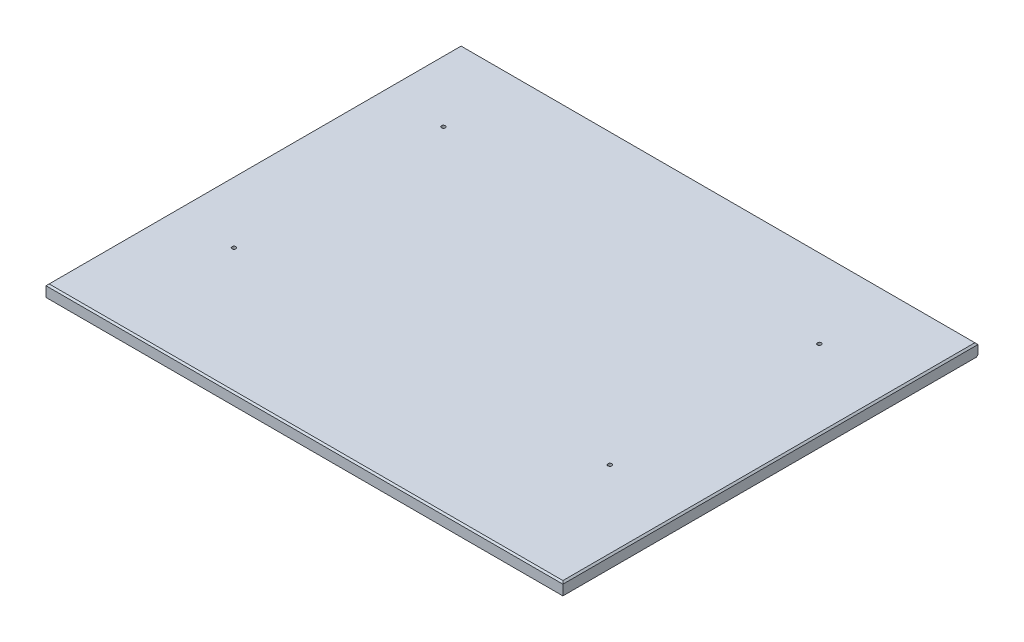
ISO-10303-21;
HEADER;
FILE_DESCRIPTION(('STEP AP214'),'2;1');
FILE_NAME('part.step','',(''),(''),'','','');
FILE_SCHEMA(('AUTOMOTIVE_DESIGN { 1 0 10303 214 1 1 1 1 }'));
ENDSEC;
DATA;
#1=APPLICATION_CONTEXT('core data for automotive mechanical design processes');
#2=APPLICATION_PROTOCOL_DEFINITION('international standard','automotive_design',2000,#1);
#3=PRODUCT_CONTEXT('',#1,'mechanical');
#4=PRODUCT('Part','Part','',(#3));
#5=PRODUCT_RELATED_PRODUCT_CATEGORY('part','',(#4));
#6=PRODUCT_DEFINITION_FORMATION('','',#4);
#7=PRODUCT_DEFINITION_CONTEXT('part definition',#1,'design');
#8=PRODUCT_DEFINITION('design','',#6,#7);
#9=PRODUCT_DEFINITION_SHAPE('','',#8);
#10=(LENGTH_UNIT() NAMED_UNIT(*) SI_UNIT(.MILLI.,.METRE.));
#11=(NAMED_UNIT(*) PLANE_ANGLE_UNIT() SI_UNIT($,.RADIAN.));
#12=(NAMED_UNIT(*) SI_UNIT($,.STERADIAN.) SOLID_ANGLE_UNIT());
#13=UNCERTAINTY_MEASURE_WITH_UNIT(LENGTH_MEASURE(1.E-05),#10,'distance_accuracy_value','');
#14=(GEOMETRIC_REPRESENTATION_CONTEXT(3) GLOBAL_UNCERTAINTY_ASSIGNED_CONTEXT((#13)) GLOBAL_UNIT_ASSIGNED_CONTEXT((#10,
#11,#12)) REPRESENTATION_CONTEXT('',''));
#15=CARTESIAN_POINT('',(0.,0.,0.));
#16=DIRECTION('',(0.,0.,1.));
#17=DIRECTION('',(1.,0.,0.));
#18=AXIS2_PLACEMENT_3D('',#15,#16,#17);
#19=CARTESIAN_POINT('',(0.,19.05,0.));
#20=DIRECTION('',(1.,0.,0.));
#21=DIRECTION('',(0.,0.,-1.));
#22=AXIS2_PLACEMENT_3D('',#19,#20,#21);
#23=PLANE('',#22);
#24=DIRECTION('',(0.,-1.,0.));
#25=VECTOR('',#24,1.);
#26=CARTESIAN_POINT('',(0.,19.05,-673.1));
#27=LINE('',#26,#25);
#28=CARTESIAN_POINT('',(0.,16.51,-673.1));
#29=VERTEX_POINT('',#28);
#30=CARTESIAN_POINT('',(0.,2.53999999999999,-673.1));
#31=VERTEX_POINT('',#30);
#32=EDGE_CURVE('E118',#29,#31,#27,.T.);
#33=ORIENTED_EDGE('',*,*,#32,.T.);
#34=DIRECTION('',(0.,-0.707106781186548,0.707106781186548));
#35=VECTOR('',#34,1.);
#36=CARTESIAN_POINT('',(0.,2.53999999999999,-673.1));
#37=LINE('',#36,#35);
#38=CARTESIAN_POINT('',(0.,0.,-670.56));
#39=VERTEX_POINT('',#38);
#40=EDGE_CURVE('E64',#31,#39,#37,.T.);
#41=ORIENTED_EDGE('',*,*,#40,.T.);
#42=DIRECTION('',(0.,0.,1.));
#43=VECTOR('',#42,1.);
#44=CARTESIAN_POINT('',(0.,0.,0.));
#45=LINE('',#44,#43);
#46=CARTESIAN_POINT('',(0.,0.,0.));
#47=VERTEX_POINT('',#46);
#48=EDGE_CURVE('E98',#39,#47,#45,.T.);
#49=ORIENTED_EDGE('',*,*,#48,.T.);
#50=DIRECTION('',(0.,-1.,0.));
#51=VECTOR('',#50,1.);
#52=CARTESIAN_POINT('',(0.,19.05,0.));
#53=LINE('',#52,#51);
#54=CARTESIAN_POINT('',(0.,16.51,0.));
#55=VERTEX_POINT('',#54);
#56=EDGE_CURVE('E100',#55,#47,#53,.T.);
#57=ORIENTED_EDGE('',*,*,#56,.F.);
#58=DIRECTION('',(0.,0.,-1.));
#59=VECTOR('',#58,1.);
#60=CARTESIAN_POINT('',(0.,16.51,0.));
#61=LINE('',#60,#59);
#62=EDGE_CURVE('E141',#55,#29,#61,.T.);
#63=ORIENTED_EDGE('',*,*,#62,.T.);
#64=EDGE_LOOP('',(#33,#41,#49,#57,#63));
#65=FACE_BOUND('',#64,.T.);
#66=ADVANCED_FACE('F41',(#65),#23,.F.);
#67=CARTESIAN_POINT('',(0.,19.05,0.));
#68=DIRECTION('',(0.,0.,-1.));
#69=DIRECTION('',(-1.,0.,0.));
#70=AXIS2_PLACEMENT_3D('',#67,#68,#69);
#71=PLANE('',#70);
#72=DIRECTION('',(0.,-1.,0.));
#73=VECTOR('',#72,1.);
#74=CARTESIAN_POINT('',(838.2,19.05,0.));
#75=LINE('',#74,#73);
#76=CARTESIAN_POINT('',(838.2,16.51,0.));
#77=VERTEX_POINT('',#76);
#78=CARTESIAN_POINT('',(838.2,0.,0.));
#79=VERTEX_POINT('',#78);
#80=EDGE_CURVE('E113',#77,#79,#75,.T.);
#81=ORIENTED_EDGE('',*,*,#80,.F.);
#82=DIRECTION('',(-1.,0.,0.));
#83=VECTOR('',#82,1.);
#84=CARTESIAN_POINT('',(0.,16.51,0.));
#85=LINE('',#84,#83);
#86=EDGE_CURVE('E111',#77,#55,#85,.T.);
#87=ORIENTED_EDGE('',*,*,#86,.T.);
#88=ORIENTED_EDGE('',*,*,#56,.T.);
#89=DIRECTION('',(1.,0.,0.));
#90=VECTOR('',#89,1.);
#91=CARTESIAN_POINT('',(0.,0.,0.));
#92=LINE('',#91,#90);
#93=EDGE_CURVE('E103',#47,#79,#92,.T.);
#94=ORIENTED_EDGE('',*,*,#93,.T.);
#95=EDGE_LOOP('',(#81,#87,#88,#94));
#96=FACE_BOUND('',#95,.T.);
#97=ADVANCED_FACE('F109',(#96),#71,.F.);
#98=CARTESIAN_POINT('',(838.2,19.05,0.));
#99=DIRECTION('',(-1.,0.,0.));
#100=DIRECTION('',(0.,0.,1.));
#101=AXIS2_PLACEMENT_3D('',#98,#99,#100);
#102=PLANE('',#101);
#103=DIRECTION('',(0.,0.,-1.));
#104=VECTOR('',#103,1.);
#105=CARTESIAN_POINT('',(838.2,0.,0.));
#106=LINE('',#105,#104);
#107=CARTESIAN_POINT('',(838.2,0.,-670.56));
#108=VERTEX_POINT('',#107);
#109=EDGE_CURVE('E116',#79,#108,#106,.T.);
#110=ORIENTED_EDGE('',*,*,#109,.T.);
#111=DIRECTION('',(0.,0.707106781186548,-0.707106781186548));
#112=VECTOR('',#111,1.);
#113=CARTESIAN_POINT('',(838.2,2.53999999999999,-673.1));
#114=LINE('',#113,#112);
#115=CARTESIAN_POINT('',(838.2,2.53999999999999,-673.1));
#116=VERTEX_POINT('',#115);
#117=EDGE_CURVE('E11',#108,#116,#114,.T.);
#118=ORIENTED_EDGE('',*,*,#117,.T.);
#119=DIRECTION('',(0.,-1.,0.));
#120=VECTOR('',#119,1.);
#121=CARTESIAN_POINT('',(838.2,19.05,-673.1));
#122=LINE('',#121,#120);
#123=CARTESIAN_POINT('',(838.2,16.51,-673.1));
#124=VERTEX_POINT('',#123);
#125=EDGE_CURVE('E123',#124,#116,#122,.T.);
#126=ORIENTED_EDGE('',*,*,#125,.F.);
#127=DIRECTION('',(0.,0.,1.));
#128=VECTOR('',#127,1.);
#129=CARTESIAN_POINT('',(838.2,16.51,0.));
#130=LINE('',#129,#128);
#131=EDGE_CURVE('E138',#124,#77,#130,.T.);
#132=ORIENTED_EDGE('',*,*,#131,.T.);
#133=ORIENTED_EDGE('',*,*,#80,.T.);
#134=EDGE_LOOP('',(#110,#118,#126,#132,#133));
#135=FACE_BOUND('',#134,.T.);
#136=ADVANCED_FACE('F175',(#135),#102,.F.);
#137=CARTESIAN_POINT('',(0.,19.05,-673.1));
#138=DIRECTION('',(0.,0.,1.));
#139=DIRECTION('',(1.,0.,0.));
#140=AXIS2_PLACEMENT_3D('',#137,#138,#139);
#141=PLANE('',#140);
#142=ORIENTED_EDGE('',*,*,#125,.T.);
#143=DIRECTION('',(-1.,0.,0.));
#144=VECTOR('',#143,1.);
#145=CARTESIAN_POINT('',(0.,2.53999999999999,-673.1));
#146=LINE('',#145,#144);
#147=EDGE_CURVE('E143',#116,#31,#146,.T.);
#148=ORIENTED_EDGE('',*,*,#147,.T.);
#149=ORIENTED_EDGE('',*,*,#32,.F.);
#150=DIRECTION('',(1.,0.,0.));
#151=VECTOR('',#150,1.);
#152=CARTESIAN_POINT('',(0.,16.51,-673.1));
#153=LINE('',#152,#151);
#154=EDGE_CURVE('E135',#29,#124,#153,.T.);
#155=ORIENTED_EDGE('',*,*,#154,.T.);
#156=EDGE_LOOP('',(#142,#148,#149,#155));
#157=FACE_BOUND('',#156,.T.);
#158=ADVANCED_FACE('F159',(#157),#141,.F.);
#159=CARTESIAN_POINT('',(0.,19.05,0.));
#160=DIRECTION('',(0.,-1.,0.));
#161=DIRECTION('',(0.,0.,-1.));
#162=AXIS2_PLACEMENT_3D('',#159,#160,#161);
#163=PLANE('',#162);
#164=CARTESIAN_POINT('',(101.6,19.05,-203.2));
#165=DIRECTION('',(0.,1.,0.));
#166=DIRECTION('',(0.,0.,1.));
#167=AXIS2_PLACEMENT_3D('',#164,#165,#166);
#168=CIRCLE('',#167,3.175);
#169=CARTESIAN_POINT('',(101.6,19.05,-200.025));
#170=VERTEX_POINT('',#169);
#171=EDGE_CURVE('E322',#170,#170,#168,.T.);
#172=ORIENTED_EDGE('',*,*,#171,.F.);
#173=EDGE_LOOP('',(#172));
#174=FACE_BOUND('',#173,.T.);
#175=CARTESIAN_POINT('',(711.2,19.05,-542.925));
#176=DIRECTION('',(0.,1.,0.));
#177=DIRECTION('',(0.,0.,1.));
#178=AXIS2_PLACEMENT_3D('',#175,#176,#177);
#179=CIRCLE('',#178,3.17500000000008);
#180=CARTESIAN_POINT('',(711.2,19.05,-539.75));
#181=VERTEX_POINT('',#180);
#182=EDGE_CURVE('E326',#181,#181,#179,.T.);
#183=ORIENTED_EDGE('',*,*,#182,.F.);
#184=EDGE_LOOP('',(#183));
#185=FACE_BOUND('',#184,.T.);
#186=CARTESIAN_POINT('',(711.2,19.05,-203.2));
#187=DIRECTION('',(0.,1.,0.));
#188=DIRECTION('',(0.,0.,1.));
#189=AXIS2_PLACEMENT_3D('',#186,#187,#188);
#190=CIRCLE('',#189,3.17500000000009);
#191=CARTESIAN_POINT('',(711.2,19.05,-200.025));
#192=VERTEX_POINT('',#191);
#193=EDGE_CURVE('E337',#192,#192,#190,.T.);
#194=ORIENTED_EDGE('',*,*,#193,.F.);
#195=EDGE_LOOP('',(#194));
#196=FACE_BOUND('',#195,.T.);
#197=CARTESIAN_POINT('',(101.6,19.05,-542.925));
#198=DIRECTION('',(0.,1.,0.));
#199=DIRECTION('',(0.,0.,1.));
#200=AXIS2_PLACEMENT_3D('',#197,#198,#199);
#201=CIRCLE('',#200,3.175);
#202=CARTESIAN_POINT('',(101.6,19.05,-539.75));
#203=VERTEX_POINT('',#202);
#204=EDGE_CURVE('E323',#203,#203,#201,.T.);
#205=ORIENTED_EDGE('',*,*,#204,.F.);
#206=EDGE_LOOP('',(#205));
#207=FACE_BOUND('',#206,.T.);
#208=DIRECTION('',(0.,0.,-1.));
#209=VECTOR('',#208,1.);
#210=CARTESIAN_POINT('',(835.66,19.05,0.));
#211=LINE('',#210,#209);
#212=CARTESIAN_POINT('',(835.66,19.05,-2.53999999999999));
#213=VERTEX_POINT('',#212);
#214=CARTESIAN_POINT('',(835.66,19.05,-670.56));
#215=VERTEX_POINT('',#214);
#216=EDGE_CURVE('E130',#213,#215,#211,.T.);
#217=ORIENTED_EDGE('',*,*,#216,.T.);
#218=DIRECTION('',(-1.,0.,0.));
#219=VECTOR('',#218,1.);
#220=CARTESIAN_POINT('',(0.,19.05,-670.56));
#221=LINE('',#220,#219);
#222=CARTESIAN_POINT('',(2.53999999999999,19.05,-670.56));
#223=VERTEX_POINT('',#222);
#224=EDGE_CURVE('E132',#215,#223,#221,.T.);
#225=ORIENTED_EDGE('',*,*,#224,.T.);
#226=DIRECTION('',(0.,0.,1.));
#227=VECTOR('',#226,1.);
#228=CARTESIAN_POINT('',(2.53999999999999,19.05,0.));
#229=LINE('',#228,#227);
#230=CARTESIAN_POINT('',(2.53999999999999,19.05,-2.53999999999999));
#231=VERTEX_POINT('',#230);
#232=EDGE_CURVE('E112',#223,#231,#229,.T.);
#233=ORIENTED_EDGE('',*,*,#232,.T.);
#234=DIRECTION('',(1.,0.,0.));
#235=VECTOR('',#234,1.);
#236=CARTESIAN_POINT('',(0.,19.05,-2.53999999999999));
#237=LINE('',#236,#235);
#238=EDGE_CURVE('E128',#231,#213,#237,.T.);
#239=ORIENTED_EDGE('',*,*,#238,.T.);
#240=EDGE_LOOP('',(#217,#225,#233,#239));
#241=FACE_BOUND('',#240,.T.);
#242=ADVANCED_FACE('F220',(#174,#185,#196,#207,#241),#163,.F.);
#243=CARTESIAN_POINT('',(0.,0.,0.));
#244=DIRECTION('',(0.,-1.,0.));
#245=DIRECTION('',(0.,0.,-1.));
#246=AXIS2_PLACEMENT_3D('',#243,#244,#245);
#247=PLANE('',#246);
#248=CARTESIAN_POINT('',(101.6,0.,-203.2));
#249=DIRECTION('',(0.,1.,0.));
#250=DIRECTION('',(0.,0.,1.));
#251=AXIS2_PLACEMENT_3D('',#248,#249,#250);
#252=CIRCLE('',#251,3.175);
#253=CARTESIAN_POINT('',(101.6,0.,-200.025));
#254=VERTEX_POINT('',#253);
#255=EDGE_CURVE('E320',#254,#254,#252,.T.);
#256=ORIENTED_EDGE('',*,*,#255,.T.);
#257=EDGE_LOOP('',(#256));
#258=FACE_BOUND('',#257,.T.);
#259=CARTESIAN_POINT('',(711.2,0.,-542.925));
#260=DIRECTION('',(0.,1.,0.));
#261=DIRECTION('',(0.,0.,1.));
#262=AXIS2_PLACEMENT_3D('',#259,#260,#261);
#263=CIRCLE('',#262,3.17500000000008);
#264=CARTESIAN_POINT('',(711.2,0.,-539.75));
#265=VERTEX_POINT('',#264);
#266=EDGE_CURVE('E334',#265,#265,#263,.T.);
#267=ORIENTED_EDGE('',*,*,#266,.T.);
#268=EDGE_LOOP('',(#267));
#269=FACE_BOUND('',#268,.T.);
#270=CARTESIAN_POINT('',(711.2,0.,-203.2));
#271=DIRECTION('',(0.,1.,0.));
#272=DIRECTION('',(0.,0.,1.));
#273=AXIS2_PLACEMENT_3D('',#270,#271,#272);
#274=CIRCLE('',#273,3.17500000000009);
#275=CARTESIAN_POINT('',(711.2,0.,-200.025));
#276=VERTEX_POINT('',#275);
#277=EDGE_CURVE('E329',#276,#276,#274,.T.);
#278=ORIENTED_EDGE('',*,*,#277,.T.);
#279=EDGE_LOOP('',(#278));
#280=FACE_BOUND('',#279,.T.);
#281=CARTESIAN_POINT('',(101.6,0.,-542.925));
#282=DIRECTION('',(0.,1.,0.));
#283=DIRECTION('',(0.,0.,1.));
#284=AXIS2_PLACEMENT_3D('',#281,#282,#283);
#285=CIRCLE('',#284,3.175);
#286=CARTESIAN_POINT('',(101.6,0.,-539.75));
#287=VERTEX_POINT('',#286);
#288=EDGE_CURVE('E147',#287,#287,#285,.T.);
#289=ORIENTED_EDGE('',*,*,#288,.T.);
#290=EDGE_LOOP('',(#289));
#291=FACE_BOUND('',#290,.T.);
#292=ORIENTED_EDGE('',*,*,#48,.F.);
#293=DIRECTION('',(1.,0.,0.));
#294=VECTOR('',#293,1.);
#295=CARTESIAN_POINT('',(838.2,0.,-670.56));
#296=LINE('',#295,#294);
#297=EDGE_CURVE('E50',#39,#108,#296,.T.);
#298=ORIENTED_EDGE('',*,*,#297,.T.);
#299=ORIENTED_EDGE('',*,*,#109,.F.);
#300=ORIENTED_EDGE('',*,*,#93,.F.);
#301=EDGE_LOOP('',(#292,#298,#299,#300));
#302=FACE_BOUND('',#301,.T.);
#303=ADVANCED_FACE('F115',(#258,#269,#280,#291,#302),#247,.T.);
#304=CARTESIAN_POINT('',(0.,19.05,-2.53999999999999));
#305=DIRECTION('',(0.,-0.707106781186547,-0.707106781186548));
#306=DIRECTION('',(1.,0.,0.));
#307=AXIS2_PLACEMENT_3D('',#304,#305,#306);
#308=PLANE('',#307);
#309=DIRECTION('',(0.577350269189626,0.577350269189626,-0.577350269189626));
#310=VECTOR('',#309,1.);
#311=CARTESIAN_POINT('',(1.69333333333332,18.2033333333333,-1.69333333333332));
#312=LINE('',#311,#310);
#313=EDGE_CURVE('E149',#55,#231,#312,.T.);
#314=ORIENTED_EDGE('',*,*,#313,.F.);
#315=ORIENTED_EDGE('',*,*,#86,.F.);
#316=DIRECTION('',(-0.577350269189626,0.577350269189626,-0.577350269189626));
#317=VECTOR('',#316,1.);
#318=CARTESIAN_POINT('',(557.106666666667,297.603333333333,-281.093333333333));
#319=LINE('',#318,#317);
#320=EDGE_CURVE('E104',#213,#77,#319,.F.);
#321=ORIENTED_EDGE('',*,*,#320,.F.);
#322=ORIENTED_EDGE('',*,*,#238,.F.);
#323=EDGE_LOOP('',(#314,#315,#321,#322));
#324=FACE_BOUND('',#323,.T.);
#325=ADVANCED_FACE('F211',(#324),#308,.F.);
#326=CARTESIAN_POINT('',(835.66,19.05,0.));
#327=DIRECTION('',(-0.707106781186548,-0.707106781186548,0.));
#328=DIRECTION('',(0.,0.,-1.));
#329=AXIS2_PLACEMENT_3D('',#326,#327,#328);
#330=PLANE('',#329);
#331=ORIENTED_EDGE('',*,*,#320,.T.);
#332=ORIENTED_EDGE('',*,*,#131,.F.);
#333=DIRECTION('',(-0.577350269189626,0.577350269189626,0.577350269189626));
#334=VECTOR('',#333,1.);
#335=CARTESIAN_POINT('',(612.14,242.57,-447.04));
#336=LINE('',#335,#334);
#337=EDGE_CURVE('E146',#215,#124,#336,.F.);
#338=ORIENTED_EDGE('',*,*,#337,.F.);
#339=ORIENTED_EDGE('',*,*,#216,.F.);
#340=EDGE_LOOP('',(#331,#332,#338,#339));
#341=FACE_BOUND('',#340,.T.);
#342=ADVANCED_FACE('F206',(#341),#330,.F.);
#343=CARTESIAN_POINT('',(2.53999999999999,19.05,0.));
#344=DIRECTION('',(0.707106781186548,-0.707106781186547,0.));
#345=DIRECTION('',(0.,0.,1.));
#346=AXIS2_PLACEMENT_3D('',#343,#344,#345);
#347=PLANE('',#346);
#348=ORIENTED_EDGE('',*,*,#313,.T.);
#349=ORIENTED_EDGE('',*,*,#232,.F.);
#350=DIRECTION('',(-0.577350269189626,-0.577350269189626,-0.577350269189626));
#351=VECTOR('',#350,1.);
#352=CARTESIAN_POINT('',(226.06,242.57,-447.04));
#353=LINE('',#352,#351);
#354=EDGE_CURVE('E144',#29,#223,#353,.F.);
#355=ORIENTED_EDGE('',*,*,#354,.F.);
#356=ORIENTED_EDGE('',*,*,#62,.F.);
#357=EDGE_LOOP('',(#348,#349,#355,#356));
#358=FACE_BOUND('',#357,.T.);
#359=ADVANCED_FACE('F167',(#358),#347,.F.);
#360=CARTESIAN_POINT('',(0.,19.05,-670.56));
#361=DIRECTION('',(0.,-0.707106781186548,0.707106781186548));
#362=DIRECTION('',(-1.,0.,0.));
#363=AXIS2_PLACEMENT_3D('',#360,#361,#362);
#364=PLANE('',#363);
#365=ORIENTED_EDGE('',*,*,#337,.T.);
#366=ORIENTED_EDGE('',*,*,#154,.F.);
#367=ORIENTED_EDGE('',*,*,#354,.T.);
#368=ORIENTED_EDGE('',*,*,#224,.F.);
#369=EDGE_LOOP('',(#365,#366,#367,#368));
#370=FACE_BOUND('',#369,.T.);
#371=ADVANCED_FACE('F171',(#370),#364,.F.);
#372=CARTESIAN_POINT('',(0.,2.53999999999999,-673.1));
#373=DIRECTION('',(0.,-0.707106781186548,-0.707106781186548));
#374=DIRECTION('',(1.,0.,0.));
#375=AXIS2_PLACEMENT_3D('',#372,#373,#374);
#376=PLANE('',#375);
#377=ORIENTED_EDGE('',*,*,#117,.F.);
#378=ORIENTED_EDGE('',*,*,#297,.F.);
#379=ORIENTED_EDGE('',*,*,#40,.F.);
#380=ORIENTED_EDGE('',*,*,#147,.F.);
#381=EDGE_LOOP('',(#377,#378,#379,#380));
#382=FACE_BOUND('',#381,.T.);
#383=ADVANCED_FACE('F44',(#382),#376,.T.);
#384=CARTESIAN_POINT('',(101.6,0.,-542.925));
#385=DIRECTION('',(0.,1.,0.));
#386=DIRECTION('',(0.,0.,1.));
#387=AXIS2_PLACEMENT_3D('',#384,#385,#386);
#388=CYLINDRICAL_SURFACE('',#387,3.175);
#389=ORIENTED_EDGE('',*,*,#288,.F.);
#390=EDGE_LOOP('',(#389));
#391=FACE_BOUND('',#390,.T.);
#392=ORIENTED_EDGE('',*,*,#204,.T.);
#393=EDGE_LOOP('',(#392));
#394=FACE_BOUND('',#393,.T.);
#395=ADVANCED_FACE('F177',(#391,#394),#388,.F.);
#396=CARTESIAN_POINT('',(711.2,0.,-203.2));
#397=DIRECTION('',(0.,1.,0.));
#398=DIRECTION('',(0.,0.,1.));
#399=AXIS2_PLACEMENT_3D('',#396,#397,#398);
#400=CYLINDRICAL_SURFACE('',#399,3.17500000000009);
#401=ORIENTED_EDGE('',*,*,#277,.F.);
#402=EDGE_LOOP('',(#401));
#403=FACE_BOUND('',#402,.T.);
#404=ORIENTED_EDGE('',*,*,#193,.T.);
#405=EDGE_LOOP('',(#404));
#406=FACE_BOUND('',#405,.T.);
#407=ADVANCED_FACE('F183',(#403,#406),#400,.F.);
#408=CARTESIAN_POINT('',(711.2,0.,-542.925));
#409=DIRECTION('',(0.,1.,0.));
#410=DIRECTION('',(0.,0.,1.));
#411=AXIS2_PLACEMENT_3D('',#408,#409,#410);
#412=CYLINDRICAL_SURFACE('',#411,3.17500000000008);
#413=ORIENTED_EDGE('',*,*,#266,.F.);
#414=EDGE_LOOP('',(#413));
#415=FACE_BOUND('',#414,.T.);
#416=ORIENTED_EDGE('',*,*,#182,.T.);
#417=EDGE_LOOP('',(#416));
#418=FACE_BOUND('',#417,.T.);
#419=ADVANCED_FACE('F295',(#415,#418),#412,.F.);
#420=CARTESIAN_POINT('',(101.6,0.,-203.2));
#421=DIRECTION('',(0.,1.,0.));
#422=DIRECTION('',(0.,0.,1.));
#423=AXIS2_PLACEMENT_3D('',#420,#421,#422);
#424=CYLINDRICAL_SURFACE('',#423,3.175);
#425=ORIENTED_EDGE('',*,*,#255,.F.);
#426=EDGE_LOOP('',(#425));
#427=FACE_BOUND('',#426,.T.);
#428=ORIENTED_EDGE('',*,*,#171,.T.);
#429=EDGE_LOOP('',(#428));
#430=FACE_BOUND('',#429,.T.);
#431=ADVANCED_FACE('F305',(#427,#430),#424,.F.);
#432=CLOSED_SHELL('',(#66,#97,#136,#158,#242,#303,#325,#342,#359,#371,#383,#395,#407,#419,#431));
#433=MANIFOLD_SOLID_BREP('B2',#432);
#434=ADVANCED_BREP_SHAPE_REPRESENTATION('',(#18,#433),#14);
#435=SHAPE_DEFINITION_REPRESENTATION(#9,#434);
ENDSEC;
END-ISO-10303-21;
